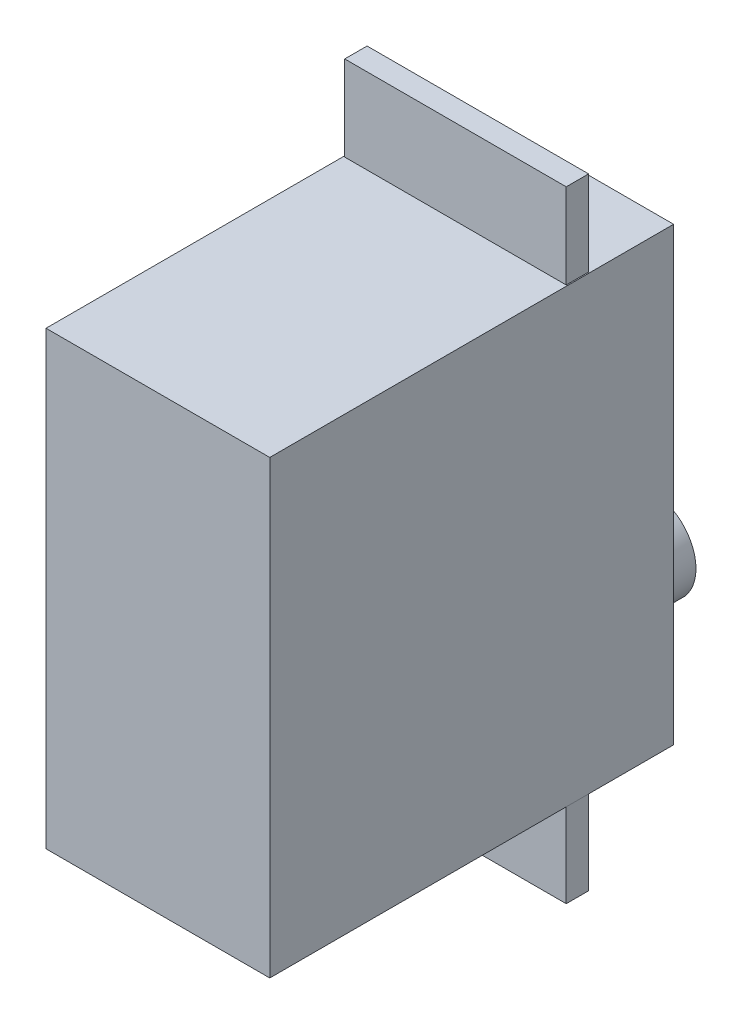
ISO-10303-21;
HEADER;
FILE_DESCRIPTION(('STEP AP214'),'2;1');
FILE_NAME('part.step','',(''),(''),'','','');
FILE_SCHEMA(('AUTOMOTIVE_DESIGN { 1 0 10303 214 1 1 1 1 }'));
ENDSEC;
DATA;
#1=APPLICATION_CONTEXT('core data for automotive mechanical design processes');
#2=APPLICATION_PROTOCOL_DEFINITION('international standard','automotive_design',2000,#1);
#3=PRODUCT_CONTEXT('',#1,'mechanical');
#4=PRODUCT('Part','Part','',(#3));
#5=PRODUCT_RELATED_PRODUCT_CATEGORY('part','',(#4));
#6=PRODUCT_DEFINITION_FORMATION('','',#4);
#7=PRODUCT_DEFINITION_CONTEXT('part definition',#1,'design');
#8=PRODUCT_DEFINITION('design','',#6,#7);
#9=PRODUCT_DEFINITION_SHAPE('','',#8);
#10=(LENGTH_UNIT() NAMED_UNIT(*) SI_UNIT(.MILLI.,.METRE.));
#11=(NAMED_UNIT(*) PLANE_ANGLE_UNIT() SI_UNIT($,.RADIAN.));
#12=(NAMED_UNIT(*) SI_UNIT($,.STERADIAN.) SOLID_ANGLE_UNIT());
#13=UNCERTAINTY_MEASURE_WITH_UNIT(LENGTH_MEASURE(1.E-05),#10,'distance_accuracy_value','');
#14=(GEOMETRIC_REPRESENTATION_CONTEXT(3) GLOBAL_UNCERTAINTY_ASSIGNED_CONTEXT((#13)) GLOBAL_UNIT_ASSIGNED_CONTEXT((#10,
#11,#12)) REPRESENTATION_CONTEXT('',''));
#15=CARTESIAN_POINT('',(0.,0.,0.));
#16=DIRECTION('',(0.,0.,1.));
#17=DIRECTION('',(1.,0.,0.));
#18=AXIS2_PLACEMENT_3D('',#15,#16,#17);
#19=CARTESIAN_POINT('',(-10.,-20.15,0.));
#20=DIRECTION('',(0.,0.,1.));
#21=DIRECTION('',(1.,0.,0.));
#22=AXIS2_PLACEMENT_3D('',#19,#20,#21);
#23=PLANE('',#22);
#24=DIRECTION('',(0.,-1.,0.));
#25=VECTOR('',#24,1.);
#26=CARTESIAN_POINT('',(-10.,20.15,0.));
#27=LINE('',#26,#25);
#28=CARTESIAN_POINT('',(-10.,20.15,0.));
#29=VERTEX_POINT('',#28);
#30=CARTESIAN_POINT('',(-10.,-20.15,0.));
#31=VERTEX_POINT('',#30);
#32=EDGE_CURVE('E181',#29,#31,#27,.T.);
#33=ORIENTED_EDGE('',*,*,#32,.F.);
#34=DIRECTION('',(-1.,0.,0.));
#35=VECTOR('',#34,1.);
#36=CARTESIAN_POINT('',(-10.,20.15,0.));
#37=LINE('',#36,#35);
#38=CARTESIAN_POINT('',(10.,20.15,0.));
#39=VERTEX_POINT('',#38);
#40=EDGE_CURVE('E186',#39,#29,#37,.T.);
#41=ORIENTED_EDGE('',*,*,#40,.F.);
#42=DIRECTION('',(0.,1.,0.));
#43=VECTOR('',#42,1.);
#44=CARTESIAN_POINT('',(10.,20.15,0.));
#45=LINE('',#44,#43);
#46=CARTESIAN_POINT('',(10.,-20.15,0.));
#47=VERTEX_POINT('',#46);
#48=EDGE_CURVE('E197',#47,#39,#45,.T.);
#49=ORIENTED_EDGE('',*,*,#48,.F.);
#50=DIRECTION('',(1.,0.,0.));
#51=VECTOR('',#50,1.);
#52=CARTESIAN_POINT('',(-10.,-20.15,0.));
#53=LINE('',#52,#51);
#54=EDGE_CURVE('E195',#31,#47,#53,.T.);
#55=ORIENTED_EDGE('',*,*,#54,.F.);
#56=EDGE_LOOP('',(#33,#41,#49,#55));
#57=FACE_BOUND('',#56,.T.);
#58=CARTESIAN_POINT('',(0.,-13.5,0.));
#59=DIRECTION('',(0.,0.,1.));
#60=DIRECTION('',(1.,0.,0.));
#61=AXIS2_PLACEMENT_3D('',#58,#59,#60);
#62=CIRCLE('',#61,4.);
#63=CARTESIAN_POINT('',(4.,-13.5,0.));
#64=VERTEX_POINT('',#63);
#65=EDGE_CURVE('E11',#64,#64,#62,.F.);
#66=ORIENTED_EDGE('',*,*,#65,.F.);
#67=EDGE_LOOP('',(#66));
#68=FACE_BOUND('',#67,.T.);
#69=ADVANCED_FACE('F33',(#57,#68),#23,.F.);
#70=CARTESIAN_POINT('',(-10.,20.15,36.1));
#71=DIRECTION('',(0.,-1.,0.));
#72=DIRECTION('',(0.,0.,-1.));
#73=AXIS2_PLACEMENT_3D('',#70,#71,#72);
#74=PLANE('',#73);
#75=ORIENTED_EDGE('',*,*,#40,.T.);
#76=DIRECTION('',(0.,0.,-1.));
#77=VECTOR('',#76,1.);
#78=CARTESIAN_POINT('',(-10.,20.15,36.1));
#79=LINE('',#78,#77);
#80=CARTESIAN_POINT('',(-10.,20.15,36.1));
#81=VERTEX_POINT('',#80);
#82=EDGE_CURVE('E192',#81,#29,#79,.T.);
#83=ORIENTED_EDGE('',*,*,#82,.F.);
#84=DIRECTION('',(-1.,0.,0.));
#85=VECTOR('',#84,1.);
#86=CARTESIAN_POINT('',(-10.,20.15,36.1));
#87=LINE('',#86,#85);
#88=CARTESIAN_POINT('',(10.,20.15,36.1));
#89=VERTEX_POINT('',#88);
#90=EDGE_CURVE('E190',#89,#81,#87,.T.);
#91=ORIENTED_EDGE('',*,*,#90,.F.);
#92=DIRECTION('',(0.,0.,-1.));
#93=VECTOR('',#92,1.);
#94=CARTESIAN_POINT('',(10.,20.15,36.1));
#95=LINE('',#94,#93);
#96=EDGE_CURVE('E202',#89,#39,#95,.T.);
#97=ORIENTED_EDGE('',*,*,#96,.T.);
#98=EDGE_LOOP('',(#75,#83,#91,#97));
#99=FACE_BOUND('',#98,.T.);
#100=DIRECTION('',(0.,0.,1.));
#101=VECTOR('',#100,1.);
#102=CARTESIAN_POINT('',(-9.9,20.15,7.5));
#103=LINE('',#102,#101);
#104=CARTESIAN_POINT('',(-9.9,20.15,7.5));
#105=VERTEX_POINT('',#104);
#106=CARTESIAN_POINT('',(-9.9,20.15,9.5));
#107=VERTEX_POINT('',#106);
#108=EDGE_CURVE('E142',#105,#107,#103,.T.);
#109=ORIENTED_EDGE('',*,*,#108,.F.);
#110=DIRECTION('',(-1.,0.,0.));
#111=VECTOR('',#110,1.);
#112=CARTESIAN_POINT('',(-9.9,20.15,7.5));
#113=LINE('',#112,#111);
#114=CARTESIAN_POINT('',(9.9,20.15,7.5));
#115=VERTEX_POINT('',#114);
#116=EDGE_CURVE('E139',#115,#105,#113,.T.);
#117=ORIENTED_EDGE('',*,*,#116,.F.);
#118=DIRECTION('',(0.,0.,-1.));
#119=VECTOR('',#118,1.);
#120=CARTESIAN_POINT('',(9.9,20.15,7.5));
#121=LINE('',#120,#119);
#122=CARTESIAN_POINT('',(9.9,20.15,9.49999999999999));
#123=VERTEX_POINT('',#122);
#124=EDGE_CURVE('E53',#123,#115,#121,.T.);
#125=ORIENTED_EDGE('',*,*,#124,.F.);
#126=DIRECTION('',(1.,0.,0.));
#127=VECTOR('',#126,1.);
#128=CARTESIAN_POINT('',(-9.9,20.15,9.5));
#129=LINE('',#128,#127);
#130=EDGE_CURVE('E48',#107,#123,#129,.T.);
#131=ORIENTED_EDGE('',*,*,#130,.F.);
#132=EDGE_LOOP('',(#109,#117,#125,#131));
#133=FACE_BOUND('',#132,.T.);
#134=ADVANCED_FACE('F227',(#99,#133),#74,.F.);
#135=CARTESIAN_POINT('',(-10.,-20.15,36.1));
#136=DIRECTION('',(0.,1.,0.));
#137=DIRECTION('',(0.,0.,1.));
#138=AXIS2_PLACEMENT_3D('',#135,#136,#137);
#139=PLANE('',#138);
#140=ORIENTED_EDGE('',*,*,#54,.T.);
#141=DIRECTION('',(0.,0.,-1.));
#142=VECTOR('',#141,1.);
#143=CARTESIAN_POINT('',(10.,-20.15,36.1));
#144=LINE('',#143,#142);
#145=CARTESIAN_POINT('',(10.,-20.15,36.1));
#146=VERTEX_POINT('',#145);
#147=EDGE_CURVE('E205',#146,#47,#144,.T.);
#148=ORIENTED_EDGE('',*,*,#147,.F.);
#149=DIRECTION('',(1.,0.,0.));
#150=VECTOR('',#149,1.);
#151=CARTESIAN_POINT('',(-10.,-20.15,36.1));
#152=LINE('',#151,#150);
#153=CARTESIAN_POINT('',(-10.,-20.15,36.1));
#154=VERTEX_POINT('',#153);
#155=EDGE_CURVE('E185',#154,#146,#152,.T.);
#156=ORIENTED_EDGE('',*,*,#155,.F.);
#157=DIRECTION('',(0.,0.,-1.));
#158=VECTOR('',#157,1.);
#159=CARTESIAN_POINT('',(-10.,-20.15,36.1));
#160=LINE('',#159,#158);
#161=EDGE_CURVE('E41',#154,#31,#160,.T.);
#162=ORIENTED_EDGE('',*,*,#161,.T.);
#163=EDGE_LOOP('',(#140,#148,#156,#162));
#164=FACE_BOUND('',#163,.T.);
#165=DIRECTION('',(0.,0.,1.));
#166=VECTOR('',#165,1.);
#167=CARTESIAN_POINT('',(9.9,-20.15,7.5));
#168=LINE('',#167,#166);
#169=CARTESIAN_POINT('',(9.9,-20.15,7.5));
#170=VERTEX_POINT('',#169);
#171=CARTESIAN_POINT('',(9.9,-20.15,9.5));
#172=VERTEX_POINT('',#171);
#173=EDGE_CURVE('E143',#170,#172,#168,.T.);
#174=ORIENTED_EDGE('',*,*,#173,.F.);
#175=DIRECTION('',(1.,0.,0.));
#176=VECTOR('',#175,1.);
#177=CARTESIAN_POINT('',(9.9,-20.15,7.5));
#178=LINE('',#177,#176);
#179=CARTESIAN_POINT('',(-9.9,-20.15,7.5));
#180=VERTEX_POINT('',#179);
#181=EDGE_CURVE('E156',#180,#170,#178,.T.);
#182=ORIENTED_EDGE('',*,*,#181,.F.);
#183=DIRECTION('',(0.,0.,-1.));
#184=VECTOR('',#183,1.);
#185=CARTESIAN_POINT('',(-9.9,-20.15,7.5));
#186=LINE('',#185,#184);
#187=CARTESIAN_POINT('',(-9.9,-20.15,9.49999999999999));
#188=VERTEX_POINT('',#187);
#189=EDGE_CURVE('E165',#188,#180,#186,.T.);
#190=ORIENTED_EDGE('',*,*,#189,.F.);
#191=DIRECTION('',(-1.,0.,0.));
#192=VECTOR('',#191,1.);
#193=CARTESIAN_POINT('',(9.9,-20.15,9.5));
#194=LINE('',#193,#192);
#195=EDGE_CURVE('E146',#172,#188,#194,.T.);
#196=ORIENTED_EDGE('',*,*,#195,.F.);
#197=EDGE_LOOP('',(#174,#182,#190,#196));
#198=FACE_BOUND('',#197,.T.);
#199=ADVANCED_FACE('F210',(#164,#198),#139,.F.);
#200=CARTESIAN_POINT('',(-10.,20.15,36.1));
#201=DIRECTION('',(1.,0.,0.));
#202=DIRECTION('',(0.,1.,0.));
#203=AXIS2_PLACEMENT_3D('',#200,#201,#202);
#204=PLANE('',#203);
#205=ORIENTED_EDGE('',*,*,#32,.T.);
#206=ORIENTED_EDGE('',*,*,#161,.F.);
#207=DIRECTION('',(0.,-1.,0.));
#208=VECTOR('',#207,1.);
#209=CARTESIAN_POINT('',(-10.,20.15,36.1));
#210=LINE('',#209,#208);
#211=EDGE_CURVE('E182',#81,#154,#210,.T.);
#212=ORIENTED_EDGE('',*,*,#211,.F.);
#213=ORIENTED_EDGE('',*,*,#82,.T.);
#214=EDGE_LOOP('',(#205,#206,#212,#213));
#215=FACE_BOUND('',#214,.T.);
#216=ADVANCED_FACE('F35',(#215),#204,.F.);
#217=CARTESIAN_POINT('',(10.,20.15,36.1));
#218=DIRECTION('',(-1.,0.,0.));
#219=DIRECTION('',(0.,-1.,0.));
#220=AXIS2_PLACEMENT_3D('',#217,#218,#219);
#221=PLANE('',#220);
#222=ORIENTED_EDGE('',*,*,#48,.T.);
#223=ORIENTED_EDGE('',*,*,#96,.F.);
#224=DIRECTION('',(0.,1.,0.));
#225=VECTOR('',#224,1.);
#226=CARTESIAN_POINT('',(10.,20.15,36.1));
#227=LINE('',#226,#225);
#228=EDGE_CURVE('E188',#146,#89,#227,.T.);
#229=ORIENTED_EDGE('',*,*,#228,.F.);
#230=ORIENTED_EDGE('',*,*,#147,.T.);
#231=EDGE_LOOP('',(#222,#223,#229,#230));
#232=FACE_BOUND('',#231,.T.);
#233=ADVANCED_FACE('F223',(#232),#221,.F.);
#234=CARTESIAN_POINT('',(-10.,-20.15,36.1));
#235=DIRECTION('',(0.,0.,1.));
#236=DIRECTION('',(1.,0.,0.));
#237=AXIS2_PLACEMENT_3D('',#234,#235,#236);
#238=PLANE('',#237);
#239=ORIENTED_EDGE('',*,*,#211,.T.);
#240=ORIENTED_EDGE('',*,*,#155,.T.);
#241=ORIENTED_EDGE('',*,*,#228,.T.);
#242=ORIENTED_EDGE('',*,*,#90,.T.);
#243=EDGE_LOOP('',(#239,#240,#241,#242));
#244=FACE_BOUND('',#243,.T.);
#245=ADVANCED_FACE('F229',(#244),#238,.T.);
#246=CARTESIAN_POINT('',(9.9,-27.75,7.5));
#247=DIRECTION('',(-1.,0.,0.));
#248=DIRECTION('',(0.,-1.,0.));
#249=AXIS2_PLACEMENT_3D('',#246,#247,#248);
#250=PLANE('',#249);
#251=ORIENTED_EDGE('',*,*,#173,.T.);
#252=DIRECTION('',(0.,1.,0.));
#253=VECTOR('',#252,1.);
#254=CARTESIAN_POINT('',(9.9,-27.75,9.5));
#255=LINE('',#254,#253);
#256=CARTESIAN_POINT('',(9.9,-27.75,9.5));
#257=VERTEX_POINT('',#256);
#258=EDGE_CURVE('E178',#257,#172,#255,.T.);
#259=ORIENTED_EDGE('',*,*,#258,.F.);
#260=DIRECTION('',(0.,0.,1.));
#261=VECTOR('',#260,1.);
#262=CARTESIAN_POINT('',(9.9,-27.75,7.5));
#263=LINE('',#262,#261);
#264=CARTESIAN_POINT('',(9.9,-27.75,7.5));
#265=VERTEX_POINT('',#264);
#266=EDGE_CURVE('E152',#265,#257,#263,.T.);
#267=ORIENTED_EDGE('',*,*,#266,.F.);
#268=DIRECTION('',(0.,1.,0.));
#269=VECTOR('',#268,1.);
#270=CARTESIAN_POINT('',(9.9,-27.75,7.5));
#271=LINE('',#270,#269);
#272=EDGE_CURVE('E161',#265,#170,#271,.T.);
#273=ORIENTED_EDGE('',*,*,#272,.T.);
#274=EDGE_LOOP('',(#251,#259,#267,#273));
#275=FACE_BOUND('',#274,.T.);
#276=ADVANCED_FACE('F231',(#275),#250,.F.);
#277=CARTESIAN_POINT('',(9.9,-27.75,9.5));
#278=DIRECTION('',(0.,0.,-1.));
#279=DIRECTION('',(-1.,0.,0.));
#280=AXIS2_PLACEMENT_3D('',#277,#278,#279);
#281=PLANE('',#280);
#282=ORIENTED_EDGE('',*,*,#195,.T.);
#283=DIRECTION('',(0.,1.,0.));
#284=VECTOR('',#283,1.);
#285=CARTESIAN_POINT('',(-9.9,-27.75,9.49999999999999));
#286=LINE('',#285,#284);
#287=CARTESIAN_POINT('',(-9.9,-27.75,9.49999999999999));
#288=VERTEX_POINT('',#287);
#289=EDGE_CURVE('E175',#288,#188,#286,.T.);
#290=ORIENTED_EDGE('',*,*,#289,.F.);
#291=DIRECTION('',(-1.,0.,0.));
#292=VECTOR('',#291,1.);
#293=CARTESIAN_POINT('',(9.9,-27.75,9.5));
#294=LINE('',#293,#292);
#295=EDGE_CURVE('E155',#257,#288,#294,.T.);
#296=ORIENTED_EDGE('',*,*,#295,.F.);
#297=ORIENTED_EDGE('',*,*,#258,.T.);
#298=EDGE_LOOP('',(#282,#290,#296,#297));
#299=FACE_BOUND('',#298,.T.);
#300=ADVANCED_FACE('F237',(#299),#281,.F.);
#301=CARTESIAN_POINT('',(-9.9,-27.75,7.5));
#302=DIRECTION('',(1.,0.,0.));
#303=DIRECTION('',(0.,1.,0.));
#304=AXIS2_PLACEMENT_3D('',#301,#302,#303);
#305=PLANE('',#304);
#306=ORIENTED_EDGE('',*,*,#189,.T.);
#307=DIRECTION('',(0.,1.,0.));
#308=VECTOR('',#307,1.);
#309=CARTESIAN_POINT('',(-9.9,-27.75,7.5));
#310=LINE('',#309,#308);
#311=CARTESIAN_POINT('',(-9.9,-27.75,7.5));
#312=VERTEX_POINT('',#311);
#313=EDGE_CURVE('E172',#312,#180,#310,.T.);
#314=ORIENTED_EDGE('',*,*,#313,.F.);
#315=DIRECTION('',(0.,0.,-1.));
#316=VECTOR('',#315,1.);
#317=CARTESIAN_POINT('',(-9.9,-27.75,7.5));
#318=LINE('',#317,#316);
#319=EDGE_CURVE('E158',#288,#312,#318,.T.);
#320=ORIENTED_EDGE('',*,*,#319,.F.);
#321=ORIENTED_EDGE('',*,*,#289,.T.);
#322=EDGE_LOOP('',(#306,#314,#320,#321));
#323=FACE_BOUND('',#322,.T.);
#324=ADVANCED_FACE('F280',(#323),#305,.F.);
#325=CARTESIAN_POINT('',(9.9,-27.75,7.5));
#326=DIRECTION('',(0.,0.,1.));
#327=DIRECTION('',(1.,0.,0.));
#328=AXIS2_PLACEMENT_3D('',#325,#326,#327);
#329=PLANE('',#328);
#330=ORIENTED_EDGE('',*,*,#181,.T.);
#331=ORIENTED_EDGE('',*,*,#272,.F.);
#332=DIRECTION('',(1.,0.,0.));
#333=VECTOR('',#332,1.);
#334=CARTESIAN_POINT('',(9.9,-27.75,7.5));
#335=LINE('',#334,#333);
#336=EDGE_CURVE('E160',#312,#265,#335,.T.);
#337=ORIENTED_EDGE('',*,*,#336,.F.);
#338=ORIENTED_EDGE('',*,*,#313,.T.);
#339=EDGE_LOOP('',(#330,#331,#337,#338));
#340=FACE_BOUND('',#339,.T.);
#341=ADVANCED_FACE('F290',(#340),#329,.F.);
#342=CARTESIAN_POINT('',(9.9,-27.75,9.5));
#343=DIRECTION('',(0.,-1.,0.));
#344=DIRECTION('',(0.,0.,-1.));
#345=AXIS2_PLACEMENT_3D('',#342,#343,#344);
#346=PLANE('',#345);
#347=ORIENTED_EDGE('',*,*,#266,.T.);
#348=ORIENTED_EDGE('',*,*,#295,.T.);
#349=ORIENTED_EDGE('',*,*,#319,.T.);
#350=ORIENTED_EDGE('',*,*,#336,.T.);
#351=EDGE_LOOP('',(#347,#348,#349,#350));
#352=FACE_BOUND('',#351,.T.);
#353=ADVANCED_FACE('F300',(#352),#346,.T.);
#354=CARTESIAN_POINT('',(-9.9,27.75,7.5));
#355=DIRECTION('',(1.,0.,0.));
#356=DIRECTION('',(0.,0.,-1.));
#357=AXIS2_PLACEMENT_3D('',#354,#355,#356);
#358=PLANE('',#357);
#359=ORIENTED_EDGE('',*,*,#108,.T.);
#360=DIRECTION('',(0.,-1.,0.));
#361=VECTOR('',#360,1.);
#362=CARTESIAN_POINT('',(-9.9,27.75,9.5));
#363=LINE('',#362,#361);
#364=CARTESIAN_POINT('',(-9.9,27.75,9.5));
#365=VERTEX_POINT('',#364);
#366=EDGE_CURVE('E123',#365,#107,#363,.T.);
#367=ORIENTED_EDGE('',*,*,#366,.F.);
#368=DIRECTION('',(0.,0.,1.));
#369=VECTOR('',#368,1.);
#370=CARTESIAN_POINT('',(-9.9,27.75,7.5));
#371=LINE('',#370,#369);
#372=CARTESIAN_POINT('',(-9.9,27.75,7.5));
#373=VERTEX_POINT('',#372);
#374=EDGE_CURVE('E130',#373,#365,#371,.T.);
#375=ORIENTED_EDGE('',*,*,#374,.F.);
#376=DIRECTION('',(0.,-1.,0.));
#377=VECTOR('',#376,1.);
#378=CARTESIAN_POINT('',(-9.9,27.75,7.5));
#379=LINE('',#378,#377);
#380=EDGE_CURVE('E395',#373,#105,#379,.T.);
#381=ORIENTED_EDGE('',*,*,#380,.T.);
#382=EDGE_LOOP('',(#359,#367,#375,#381));
#383=FACE_BOUND('',#382,.T.);
#384=ADVANCED_FACE('F141',(#383),#358,.F.);
#385=CARTESIAN_POINT('',(-9.9,27.75,9.5));
#386=DIRECTION('',(0.,0.,-1.));
#387=DIRECTION('',(-1.,0.,0.));
#388=AXIS2_PLACEMENT_3D('',#385,#386,#387);
#389=PLANE('',#388);
#390=ORIENTED_EDGE('',*,*,#130,.T.);
#391=DIRECTION('',(0.,-1.,0.));
#392=VECTOR('',#391,1.);
#393=CARTESIAN_POINT('',(9.9,27.75,9.5));
#394=LINE('',#393,#392);
#395=CARTESIAN_POINT('',(9.9,27.75,9.5));
#396=VERTEX_POINT('',#395);
#397=EDGE_CURVE('E126',#396,#123,#394,.T.);
#398=ORIENTED_EDGE('',*,*,#397,.F.);
#399=DIRECTION('',(1.,0.,0.));
#400=VECTOR('',#399,1.);
#401=CARTESIAN_POINT('',(-9.9,27.75,9.5));
#402=LINE('',#401,#400);
#403=EDGE_CURVE('E119',#365,#396,#402,.T.);
#404=ORIENTED_EDGE('',*,*,#403,.F.);
#405=ORIENTED_EDGE('',*,*,#366,.T.);
#406=EDGE_LOOP('',(#390,#398,#404,#405));
#407=FACE_BOUND('',#406,.T.);
#408=ADVANCED_FACE('F121',(#407),#389,.F.);
#409=CARTESIAN_POINT('',(9.9,27.75,7.5));
#410=DIRECTION('',(-1.,0.,0.));
#411=DIRECTION('',(0.,0.,1.));
#412=AXIS2_PLACEMENT_3D('',#409,#410,#411);
#413=PLANE('',#412);
#414=ORIENTED_EDGE('',*,*,#124,.T.);
#415=DIRECTION('',(0.,-1.,0.));
#416=VECTOR('',#415,1.);
#417=CARTESIAN_POINT('',(9.9,27.75,7.5));
#418=LINE('',#417,#416);
#419=CARTESIAN_POINT('',(9.9,27.75,7.5));
#420=VERTEX_POINT('',#419);
#421=EDGE_CURVE('E148',#420,#115,#418,.T.);
#422=ORIENTED_EDGE('',*,*,#421,.F.);
#423=DIRECTION('',(0.,0.,-1.));
#424=VECTOR('',#423,1.);
#425=CARTESIAN_POINT('',(9.9,27.75,7.5));
#426=LINE('',#425,#424);
#427=EDGE_CURVE('E129',#396,#420,#426,.T.);
#428=ORIENTED_EDGE('',*,*,#427,.F.);
#429=ORIENTED_EDGE('',*,*,#397,.T.);
#430=EDGE_LOOP('',(#414,#422,#428,#429));
#431=FACE_BOUND('',#430,.T.);
#432=ADVANCED_FACE('F333',(#431),#413,.F.);
#433=CARTESIAN_POINT('',(-9.9,27.75,7.5));
#434=DIRECTION('',(0.,0.,1.));
#435=DIRECTION('',(1.,0.,0.));
#436=AXIS2_PLACEMENT_3D('',#433,#434,#435);
#437=PLANE('',#436);
#438=ORIENTED_EDGE('',*,*,#116,.T.);
#439=ORIENTED_EDGE('',*,*,#380,.F.);
#440=DIRECTION('',(-1.,0.,0.));
#441=VECTOR('',#440,1.);
#442=CARTESIAN_POINT('',(-9.9,27.75,7.5));
#443=LINE('',#442,#441);
#444=EDGE_CURVE('E135',#420,#373,#443,.T.);
#445=ORIENTED_EDGE('',*,*,#444,.F.);
#446=ORIENTED_EDGE('',*,*,#421,.T.);
#447=EDGE_LOOP('',(#438,#439,#445,#446));
#448=FACE_BOUND('',#447,.T.);
#449=ADVANCED_FACE('F342',(#448),#437,.F.);
#450=CARTESIAN_POINT('',(-9.9,27.75,9.5));
#451=DIRECTION('',(0.,1.,0.));
#452=DIRECTION('',(0.,0.,1.));
#453=AXIS2_PLACEMENT_3D('',#450,#451,#452);
#454=PLANE('',#453);
#455=ORIENTED_EDGE('',*,*,#374,.T.);
#456=ORIENTED_EDGE('',*,*,#403,.T.);
#457=ORIENTED_EDGE('',*,*,#427,.T.);
#458=ORIENTED_EDGE('',*,*,#444,.T.);
#459=EDGE_LOOP('',(#455,#456,#457,#458));
#460=FACE_BOUND('',#459,.T.);
#461=ADVANCED_FACE('F133',(#460),#454,.T.);
#462=CARTESIAN_POINT('',(0.,-13.5,-8.));
#463=DIRECTION('',(0.,0.,1.));
#464=DIRECTION('',(1.,0.,0.));
#465=AXIS2_PLACEMENT_3D('',#462,#463,#464);
#466=CYLINDRICAL_SURFACE('',#465,4.);
#467=CARTESIAN_POINT('',(0.,-13.5,-8.));
#468=DIRECTION('',(0.,0.,-1.));
#469=DIRECTION('',(-1.,0.,0.));
#470=AXIS2_PLACEMENT_3D('',#467,#468,#469);
#471=CIRCLE('',#470,4.);
#472=CARTESIAN_POINT('',(-4.,-13.5,-8.));
#473=VERTEX_POINT('',#472);
#474=EDGE_CURVE('E390',#473,#473,#471,.T.);
#475=ORIENTED_EDGE('',*,*,#474,.F.);
#476=EDGE_LOOP('',(#475));
#477=FACE_BOUND('',#476,.T.);
#478=ORIENTED_EDGE('',*,*,#65,.T.);
#479=EDGE_LOOP('',(#478));
#480=FACE_BOUND('',#479,.T.);
#481=ADVANCED_FACE('F360',(#477,#480),#466,.T.);
#482=CARTESIAN_POINT('',(0.,-13.5,-8.));
#483=DIRECTION('',(0.,0.,-1.));
#484=DIRECTION('',(-1.,0.,0.));
#485=AXIS2_PLACEMENT_3D('',#482,#483,#484);
#486=PLANE('',#485);
#487=ORIENTED_EDGE('',*,*,#474,.T.);
#488=EDGE_LOOP('',(#487));
#489=FACE_BOUND('',#488,.T.);
#490=ADVANCED_FACE('F374',(#489),#486,.T.);
#491=CLOSED_SHELL('',(#69,#134,#199,#216,#233,#245,#276,#300,#324,#341,#353,#384,#408,#432,#449,
#461,#481,#490));
#492=MANIFOLD_SOLID_BREP('B2',#491);
#493=ADVANCED_BREP_SHAPE_REPRESENTATION('',(#18,#492),#14);
#494=SHAPE_DEFINITION_REPRESENTATION(#9,#493);
ENDSEC;
END-ISO-10303-21;
